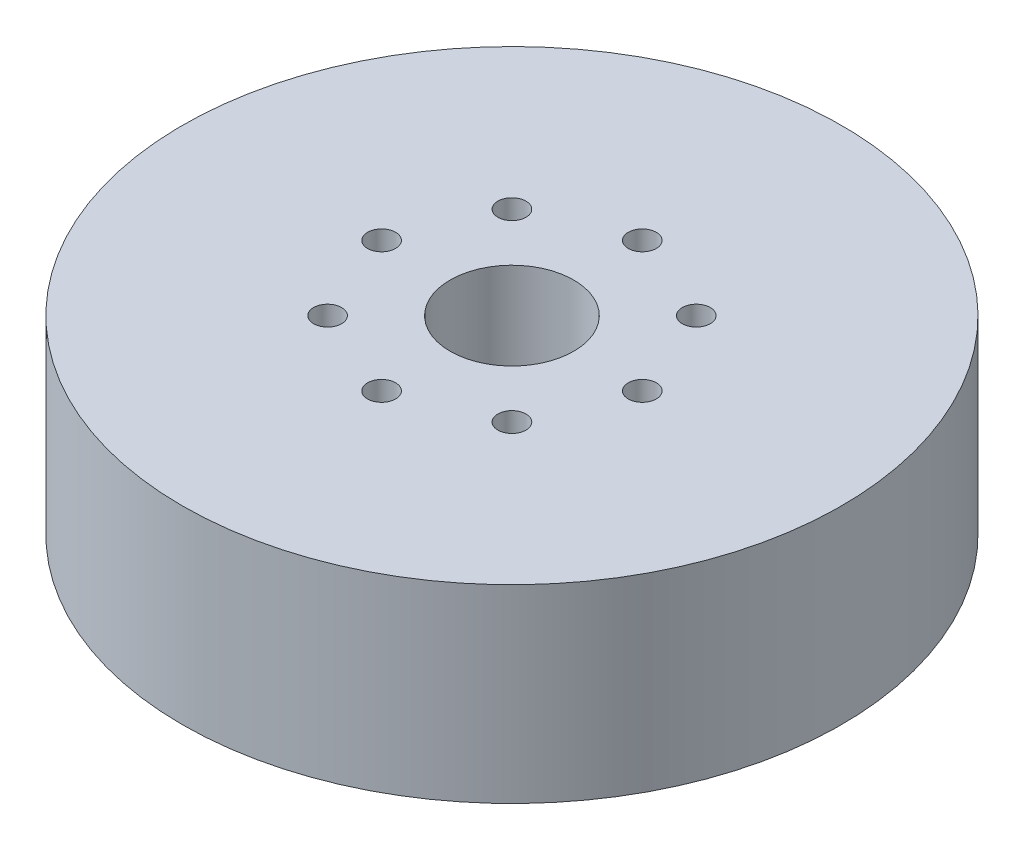
ISO-10303-21;
HEADER;
FILE_DESCRIPTION(('STEP AP214'),'2;1');
FILE_NAME('part.step','',(''),(''),'','','');
FILE_SCHEMA(('AUTOMOTIVE_DESIGN { 1 0 10303 214 1 1 1 1 }'));
ENDSEC;
DATA;
#1=APPLICATION_CONTEXT('core data for automotive mechanical design processes');
#2=APPLICATION_PROTOCOL_DEFINITION('international standard','automotive_design',2000,#1);
#3=PRODUCT_CONTEXT('',#1,'mechanical');
#4=PRODUCT('Part','Part','',(#3));
#5=PRODUCT_RELATED_PRODUCT_CATEGORY('part','',(#4));
#6=PRODUCT_DEFINITION_FORMATION('','',#4);
#7=PRODUCT_DEFINITION_CONTEXT('part definition',#1,'design');
#8=PRODUCT_DEFINITION('design','',#6,#7);
#9=PRODUCT_DEFINITION_SHAPE('','',#8);
#10=(LENGTH_UNIT() NAMED_UNIT(*) SI_UNIT(.MILLI.,.METRE.));
#11=(NAMED_UNIT(*) PLANE_ANGLE_UNIT() SI_UNIT($,.RADIAN.));
#12=(NAMED_UNIT(*) SI_UNIT($,.STERADIAN.) SOLID_ANGLE_UNIT());
#13=UNCERTAINTY_MEASURE_WITH_UNIT(LENGTH_MEASURE(1.E-05),#10,'distance_accuracy_value','');
#14=(GEOMETRIC_REPRESENTATION_CONTEXT(3) GLOBAL_UNCERTAINTY_ASSIGNED_CONTEXT((#13)) GLOBAL_UNIT_ASSIGNED_CONTEXT((#10,
#11,#12)) REPRESENTATION_CONTEXT('',''));
#15=CARTESIAN_POINT('',(0.,0.,0.));
#16=DIRECTION('',(0.,0.,1.));
#17=DIRECTION('',(1.,0.,0.));
#18=AXIS2_PLACEMENT_3D('',#15,#16,#17);
#19=CARTESIAN_POINT('',(0.,23.,0.));
#20=DIRECTION('',(0.,-1.,0.));
#21=DIRECTION('',(0.,0.,-1.));
#22=AXIS2_PLACEMENT_3D('',#19,#20,#21);
#23=CYLINDRICAL_SURFACE('',#22,40.);
#24=CARTESIAN_POINT('',(0.,23.,0.));
#25=DIRECTION('',(0.,1.,0.));
#26=DIRECTION('',(0.,0.,1.));
#27=AXIS2_PLACEMENT_3D('',#24,#25,#26);
#28=CIRCLE('',#27,40.);
#29=CARTESIAN_POINT('',(0.,23.,40.));
#30=VERTEX_POINT('',#29);
#31=EDGE_CURVE('E10',#30,#30,#28,.T.);
#32=ORIENTED_EDGE('',*,*,#31,.F.);
#33=EDGE_LOOP('',(#32));
#34=FACE_BOUND('',#33,.T.);
#35=CARTESIAN_POINT('',(0.,0.,0.));
#36=DIRECTION('',(0.,1.,0.));
#37=DIRECTION('',(0.,0.,1.));
#38=AXIS2_PLACEMENT_3D('',#35,#36,#37);
#39=CIRCLE('',#38,40.);
#40=CARTESIAN_POINT('',(0.,0.,40.));
#41=VERTEX_POINT('',#40);
#42=EDGE_CURVE('E37',#41,#41,#39,.T.);
#43=ORIENTED_EDGE('',*,*,#42,.T.);
#44=EDGE_LOOP('',(#43));
#45=FACE_BOUND('',#44,.T.);
#46=ADVANCED_FACE('F40',(#34,#45),#23,.T.);
#47=CARTESIAN_POINT('',(0.,23.,0.));
#48=DIRECTION('',(0.,1.,0.));
#49=DIRECTION('',(0.,0.,1.));
#50=AXIS2_PLACEMENT_3D('',#47,#48,#49);
#51=PLANE('',#50);
#52=CARTESIAN_POINT('',(0.,23.,15.8196777522816));
#53=DIRECTION('',(0.,1.,0.));
#54=DIRECTION('',(1.,0.,0.));
#55=AXIS2_PLACEMENT_3D('',#52,#53,#54);
#56=CIRCLE('',#55,1.70390734425643);
#57=CARTESIAN_POINT('',(1.70390734425648,23.,15.8196777522816));
#58=VERTEX_POINT('',#57);
#59=EDGE_CURVE('E88',#58,#58,#56,.T.);
#60=ORIENTED_EDGE('',*,*,#59,.F.);
#61=EDGE_LOOP('',(#60));
#62=FACE_BOUND('',#61,.T.);
#63=CARTESIAN_POINT('',(11.1862014148243,23.,11.1862014148242));
#64=DIRECTION('',(0.,1.,0.));
#65=DIRECTION('',(0.707106781186544,0.,-0.707106781186551));
#66=AXIS2_PLACEMENT_3D('',#63,#64,#65);
#67=CIRCLE('',#66,1.70390734425643);
#68=CARTESIAN_POINT('',(12.3910458524616,23.,9.98135697718694));
#69=VERTEX_POINT('',#68);
#70=EDGE_CURVE('E79',#69,#69,#67,.T.);
#71=ORIENTED_EDGE('',*,*,#70,.F.);
#72=EDGE_LOOP('',(#71));
#73=FACE_BOUND('',#72,.T.);
#74=CARTESIAN_POINT('',(15.8196777522816,23.,0.));
#75=DIRECTION('',(0.,1.,0.));
#76=DIRECTION('',(0.,0.,-1.));
#77=AXIS2_PLACEMENT_3D('',#74,#75,#76);
#78=CIRCLE('',#77,1.70390734425643);
#79=CARTESIAN_POINT('',(15.8196777522816,23.,-1.70390734425643));
#80=VERTEX_POINT('',#79);
#81=EDGE_CURVE('E74',#80,#80,#78,.T.);
#82=ORIENTED_EDGE('',*,*,#81,.F.);
#83=EDGE_LOOP('',(#82));
#84=FACE_BOUND('',#83,.T.);
#85=CARTESIAN_POINT('',(11.1862014148242,23.,-11.1862014148244));
#86=DIRECTION('',(0.,1.,0.));
#87=DIRECTION('',(-0.707106781186554,0.,-0.707106781186541));
#88=AXIS2_PLACEMENT_3D('',#85,#86,#87);
#89=CIRCLE('',#88,1.70390734425643);
#90=CARTESIAN_POINT('',(9.9813569771869,23.,-12.3910458524617));
#91=VERTEX_POINT('',#90);
#92=EDGE_CURVE('E70',#91,#91,#89,.T.);
#93=ORIENTED_EDGE('',*,*,#92,.F.);
#94=EDGE_LOOP('',(#93));
#95=FACE_BOUND('',#94,.T.);
#96=CARTESIAN_POINT('',(-1.65702328975809E-13,23.,-15.8196777522816));
#97=DIRECTION('',(0.,1.,0.));
#98=DIRECTION('',(-1.,0.,0.));
#99=AXIS2_PLACEMENT_3D('',#96,#97,#98);
#100=CIRCLE('',#99,1.70390734425643);
#101=CARTESIAN_POINT('',(-1.70390734425659,23.,-15.8196777522816));
#102=VERTEX_POINT('',#101);
#103=EDGE_CURVE('E100',#102,#102,#100,.T.);
#104=ORIENTED_EDGE('',*,*,#103,.F.);
#105=EDGE_LOOP('',(#104));
#106=FACE_BOUND('',#105,.T.);
#107=CARTESIAN_POINT('',(-11.1862014148244,23.,-11.1862014148241));
#108=DIRECTION('',(0.,1.,0.));
#109=DIRECTION('',(-0.707106781186539,0.,0.707106781186556));
#110=AXIS2_PLACEMENT_3D('',#107,#108,#109);
#111=CIRCLE('',#110,1.70390734425643);
#112=CARTESIAN_POINT('',(-12.3910458524617,23.,-9.98135697718685));
#113=VERTEX_POINT('',#112);
#114=EDGE_CURVE('E93',#113,#113,#111,.T.);
#115=ORIENTED_EDGE('',*,*,#114,.F.);
#116=EDGE_LOOP('',(#115));
#117=FACE_BOUND('',#116,.T.);
#118=CARTESIAN_POINT('',(-11.1862014148243,23.,11.1862014148243));
#119=DIRECTION('',(0.,1.,0.));
#120=DIRECTION('',(0.707106781186549,0.,0.707106781186546));
#121=AXIS2_PLACEMENT_3D('',#118,#119,#120);
#122=CIRCLE('',#121,1.70390734425643);
#123=CARTESIAN_POINT('',(-9.98135697718698,23.,12.3910458524616));
#124=VERTEX_POINT('',#123);
#125=EDGE_CURVE('E61',#124,#124,#122,.T.);
#126=ORIENTED_EDGE('',*,*,#125,.F.);
#127=EDGE_LOOP('',(#126));
#128=FACE_BOUND('',#127,.T.);
#129=CARTESIAN_POINT('',(-15.8196777522816,23.,0.));
#130=DIRECTION('',(0.,1.,0.));
#131=DIRECTION('',(0.,0.,1.));
#132=AXIS2_PLACEMENT_3D('',#129,#130,#131);
#133=CIRCLE('',#132,1.70390734425643);
#134=CARTESIAN_POINT('',(-15.8196777522816,23.,1.70390734425643));
#135=VERTEX_POINT('',#134);
#136=EDGE_CURVE('E54',#135,#135,#133,.T.);
#137=ORIENTED_EDGE('',*,*,#136,.F.);
#138=EDGE_LOOP('',(#137));
#139=FACE_BOUND('',#138,.T.);
#140=CARTESIAN_POINT('',(0.,23.,0.));
#141=DIRECTION('',(0.,1.,0.));
#142=DIRECTION('',(0.,0.,1.));
#143=AXIS2_PLACEMENT_3D('',#140,#141,#142);
#144=CIRCLE('',#143,7.5);
#145=CARTESIAN_POINT('',(0.,23.,7.5));
#146=VERTEX_POINT('',#145);
#147=EDGE_CURVE('E50',#146,#146,#144,.T.);
#148=ORIENTED_EDGE('',*,*,#147,.F.);
#149=EDGE_LOOP('',(#148));
#150=FACE_BOUND('',#149,.T.);
#151=ORIENTED_EDGE('',*,*,#31,.T.);
#152=EDGE_LOOP('',(#151));
#153=FACE_BOUND('',#152,.T.);
#154=ADVANCED_FACE('F115',(#62,#73,#84,#95,#106,#117,#128,#139,#150,#153),#51,.T.);
#155=CARTESIAN_POINT('',(0.,0.,0.));
#156=DIRECTION('',(0.,1.,0.));
#157=DIRECTION('',(0.,0.,1.));
#158=AXIS2_PLACEMENT_3D('',#155,#156,#157);
#159=PLANE('',#158);
#160=CARTESIAN_POINT('',(0.,0.,0.));
#161=DIRECTION('',(0.,1.,0.));
#162=DIRECTION('',(0.,0.,1.));
#163=AXIS2_PLACEMENT_3D('',#160,#161,#162);
#164=CIRCLE('',#163,7.5);
#165=CARTESIAN_POINT('',(0.,0.,7.5));
#166=VERTEX_POINT('',#165);
#167=EDGE_CURVE('E47',#166,#166,#164,.T.);
#168=ORIENTED_EDGE('',*,*,#167,.T.);
#169=EDGE_LOOP('',(#168));
#170=FACE_BOUND('',#169,.T.);
#171=ORIENTED_EDGE('',*,*,#42,.F.);
#172=EDGE_LOOP('',(#171));
#173=FACE_BOUND('',#172,.T.);
#174=ADVANCED_FACE('F113',(#170,#173),#159,.F.);
#175=CARTESIAN_POINT('',(0.,23.,0.));
#176=DIRECTION('',(0.,-1.,0.));
#177=DIRECTION('',(0.,0.,-1.));
#178=AXIS2_PLACEMENT_3D('',#175,#176,#177);
#179=CYLINDRICAL_SURFACE('',#178,7.5);
#180=ORIENTED_EDGE('',*,*,#147,.T.);
#181=EDGE_LOOP('',(#180));
#182=FACE_BOUND('',#181,.T.);
#183=ORIENTED_EDGE('',*,*,#167,.F.);
#184=EDGE_LOOP('',(#183));
#185=FACE_BOUND('',#184,.T.);
#186=ADVANCED_FACE('F127',(#182,#185),#179,.F.);
#187=CARTESIAN_POINT('',(-15.8196777522816,6.71406212941944,0.));
#188=DIRECTION('',(0.,1.,0.));
#189=DIRECTION('',(0.,0.,1.));
#190=AXIS2_PLACEMENT_3D('',#187,#188,#189);
#191=CYLINDRICAL_SURFACE('',#190,1.70390734425643);
#192=CARTESIAN_POINT('',(-15.8196777522816,6.71406212941944,0.));
#193=DIRECTION('',(0.,1.,0.));
#194=DIRECTION('',(0.,0.,1.));
#195=AXIS2_PLACEMENT_3D('',#192,#193,#194);
#196=CIRCLE('',#195,1.70390734425643);
#197=CARTESIAN_POINT('',(-15.8196777522816,6.71406212941944,1.70390734425643));
#198=VERTEX_POINT('',#197);
#199=EDGE_CURVE('E55',#198,#198,#196,.T.);
#200=ORIENTED_EDGE('',*,*,#199,.F.);
#201=EDGE_LOOP('',(#200));
#202=FACE_BOUND('',#201,.T.);
#203=ORIENTED_EDGE('',*,*,#136,.T.);
#204=EDGE_LOOP('',(#203));
#205=FACE_BOUND('',#204,.T.);
#206=ADVANCED_FACE('F129',(#202,#205),#191,.F.);
#207=CARTESIAN_POINT('',(-15.8196777522816,6.71406212941944,0.));
#208=DIRECTION('',(0.,1.,0.));
#209=DIRECTION('',(0.,0.,1.));
#210=AXIS2_PLACEMENT_3D('',#207,#208,#209);
#211=PLANE('',#210);
#212=ORIENTED_EDGE('',*,*,#199,.T.);
#213=EDGE_LOOP('',(#212));
#214=FACE_BOUND('',#213,.T.);
#215=ADVANCED_FACE('F157',(#214),#211,.T.);
#216=CARTESIAN_POINT('',(-11.1862014148243,6.71406212941944,11.1862014148243));
#217=DIRECTION('',(0.,1.,0.));
#218=DIRECTION('',(0.,0.,1.));
#219=AXIS2_PLACEMENT_3D('',#216,#217,#218);
#220=CYLINDRICAL_SURFACE('',#219,1.70390734425643);
#221=CARTESIAN_POINT('',(-11.1862014148243,6.71406212941944,11.1862014148243));
#222=DIRECTION('',(0.,1.,0.));
#223=DIRECTION('',(0.707106781186549,0.,0.707106781186546));
#224=AXIS2_PLACEMENT_3D('',#221,#222,#223);
#225=CIRCLE('',#224,1.70390734425643);
#226=CARTESIAN_POINT('',(-9.98135697718698,6.71406212941944,12.3910458524616));
#227=VERTEX_POINT('',#226);
#228=EDGE_CURVE('E59',#227,#227,#225,.T.);
#229=ORIENTED_EDGE('',*,*,#228,.F.);
#230=EDGE_LOOP('',(#229));
#231=FACE_BOUND('',#230,.T.);
#232=ORIENTED_EDGE('',*,*,#125,.T.);
#233=EDGE_LOOP('',(#232));
#234=FACE_BOUND('',#233,.T.);
#235=ADVANCED_FACE('F170',(#231,#234),#220,.F.);
#236=CARTESIAN_POINT('',(-11.1862014148243,6.71406212941944,11.1862014148243));
#237=DIRECTION('',(0.,1.,0.));
#238=DIRECTION('',(0.707106781186549,0.,0.707106781186546));
#239=AXIS2_PLACEMENT_3D('',#236,#237,#238);
#240=PLANE('',#239);
#241=ORIENTED_EDGE('',*,*,#228,.T.);
#242=EDGE_LOOP('',(#241));
#243=FACE_BOUND('',#242,.T.);
#244=ADVANCED_FACE('F182',(#243),#240,.T.);
#245=CARTESIAN_POINT('',(-11.1862014148244,6.71406212941944,-11.1862014148241));
#246=DIRECTION('',(0.,1.,0.));
#247=DIRECTION('',(0.,0.,1.));
#248=AXIS2_PLACEMENT_3D('',#245,#246,#247);
#249=CYLINDRICAL_SURFACE('',#248,1.70390734425643);
#250=CARTESIAN_POINT('',(-11.1862014148244,6.71406212941944,-11.1862014148241));
#251=DIRECTION('',(0.,1.,0.));
#252=DIRECTION('',(-0.707106781186539,0.,0.707106781186556));
#253=AXIS2_PLACEMENT_3D('',#250,#251,#252);
#254=CIRCLE('',#253,1.70390734425643);
#255=CARTESIAN_POINT('',(-12.3910458524617,6.71406212941944,-9.98135697718685));
#256=VERTEX_POINT('',#255);
#257=EDGE_CURVE('E94',#256,#256,#254,.T.);
#258=ORIENTED_EDGE('',*,*,#257,.F.);
#259=EDGE_LOOP('',(#258));
#260=FACE_BOUND('',#259,.T.);
#261=ORIENTED_EDGE('',*,*,#114,.T.);
#262=EDGE_LOOP('',(#261));
#263=FACE_BOUND('',#262,.T.);
#264=ADVANCED_FACE('F189',(#260,#263),#249,.F.);
#265=CARTESIAN_POINT('',(-11.1862014148244,6.71406212941944,-11.1862014148241));
#266=DIRECTION('',(0.,1.,0.));
#267=DIRECTION('',(-0.707106781186539,0.,0.707106781186556));
#268=AXIS2_PLACEMENT_3D('',#265,#266,#267);
#269=PLANE('',#268);
#270=ORIENTED_EDGE('',*,*,#257,.T.);
#271=EDGE_LOOP('',(#270));
#272=FACE_BOUND('',#271,.T.);
#273=ADVANCED_FACE('F107',(#272),#269,.T.);
#274=CARTESIAN_POINT('',(-1.65702328975809E-13,6.71406212941944,-15.8196777522816));
#275=DIRECTION('',(0.,1.,0.));
#276=DIRECTION('',(0.,0.,1.));
#277=AXIS2_PLACEMENT_3D('',#274,#275,#276);
#278=CYLINDRICAL_SURFACE('',#277,1.70390734425643);
#279=CARTESIAN_POINT('',(-1.65702328975809E-13,6.71406212941944,-15.8196777522816));
#280=DIRECTION('',(0.,1.,0.));
#281=DIRECTION('',(-1.,0.,0.));
#282=AXIS2_PLACEMENT_3D('',#279,#280,#281);
#283=CIRCLE('',#282,1.70390734425643);
#284=CARTESIAN_POINT('',(-1.70390734425659,6.71406212941944,-15.8196777522816));
#285=VERTEX_POINT('',#284);
#286=EDGE_CURVE('E72',#285,#285,#283,.T.);
#287=ORIENTED_EDGE('',*,*,#286,.F.);
#288=EDGE_LOOP('',(#287));
#289=FACE_BOUND('',#288,.T.);
#290=ORIENTED_EDGE('',*,*,#103,.T.);
#291=EDGE_LOOP('',(#290));
#292=FACE_BOUND('',#291,.T.);
#293=ADVANCED_FACE('F104',(#289,#292),#278,.F.);
#294=CARTESIAN_POINT('',(-1.65702328975809E-13,6.71406212941944,-15.8196777522816));
#295=DIRECTION('',(0.,1.,0.));
#296=DIRECTION('',(-1.,0.,0.));
#297=AXIS2_PLACEMENT_3D('',#294,#295,#296);
#298=PLANE('',#297);
#299=ORIENTED_EDGE('',*,*,#286,.T.);
#300=EDGE_LOOP('',(#299));
#301=FACE_BOUND('',#300,.T.);
#302=ADVANCED_FACE('F103',(#301),#298,.T.);
#303=CARTESIAN_POINT('',(11.1862014148242,6.71406212941944,-11.1862014148244));
#304=DIRECTION('',(0.,1.,0.));
#305=DIRECTION('',(0.,0.,1.));
#306=AXIS2_PLACEMENT_3D('',#303,#304,#305);
#307=CYLINDRICAL_SURFACE('',#306,1.70390734425643);
#308=CARTESIAN_POINT('',(11.1862014148242,6.71406212941944,-11.1862014148244));
#309=DIRECTION('',(0.,1.,0.));
#310=DIRECTION('',(-0.707106781186554,0.,-0.707106781186541));
#311=AXIS2_PLACEMENT_3D('',#308,#309,#310);
#312=CIRCLE('',#311,1.70390734425643);
#313=CARTESIAN_POINT('',(9.9813569771869,6.71406212941944,-12.3910458524617));
#314=VERTEX_POINT('',#313);
#315=EDGE_CURVE('E69',#314,#314,#312,.T.);
#316=ORIENTED_EDGE('',*,*,#315,.F.);
#317=EDGE_LOOP('',(#316));
#318=FACE_BOUND('',#317,.T.);
#319=ORIENTED_EDGE('',*,*,#92,.T.);
#320=EDGE_LOOP('',(#319));
#321=FACE_BOUND('',#320,.T.);
#322=ADVANCED_FACE('F219',(#318,#321),#307,.F.);
#323=CARTESIAN_POINT('',(11.1862014148242,6.71406212941944,-11.1862014148244));
#324=DIRECTION('',(0.,1.,0.));
#325=DIRECTION('',(-0.707106781186554,0.,-0.707106781186541));
#326=AXIS2_PLACEMENT_3D('',#323,#324,#325);
#327=PLANE('',#326);
#328=ORIENTED_EDGE('',*,*,#315,.T.);
#329=EDGE_LOOP('',(#328));
#330=FACE_BOUND('',#329,.T.);
#331=ADVANCED_FACE('F227',(#330),#327,.T.);
#332=CARTESIAN_POINT('',(15.8196777522816,6.71406212941944,0.));
#333=DIRECTION('',(0.,1.,0.));
#334=DIRECTION('',(0.,0.,1.));
#335=AXIS2_PLACEMENT_3D('',#332,#333,#334);
#336=CYLINDRICAL_SURFACE('',#335,1.70390734425643);
#337=CARTESIAN_POINT('',(15.8196777522816,6.71406212941944,0.));
#338=DIRECTION('',(0.,1.,0.));
#339=DIRECTION('',(0.,0.,-1.));
#340=AXIS2_PLACEMENT_3D('',#337,#338,#339);
#341=CIRCLE('',#340,1.70390734425643);
#342=CARTESIAN_POINT('',(15.8196777522816,6.71406212941944,-1.70390734425643));
#343=VERTEX_POINT('',#342);
#344=EDGE_CURVE('E80',#343,#343,#341,.T.);
#345=ORIENTED_EDGE('',*,*,#344,.F.);
#346=EDGE_LOOP('',(#345));
#347=FACE_BOUND('',#346,.T.);
#348=ORIENTED_EDGE('',*,*,#81,.T.);
#349=EDGE_LOOP('',(#348));
#350=FACE_BOUND('',#349,.T.);
#351=ADVANCED_FACE('F240',(#347,#350),#336,.F.);
#352=CARTESIAN_POINT('',(15.8196777522816,6.71406212941944,0.));
#353=DIRECTION('',(0.,1.,0.));
#354=DIRECTION('',(0.,0.,-1.));
#355=AXIS2_PLACEMENT_3D('',#352,#353,#354);
#356=PLANE('',#355);
#357=ORIENTED_EDGE('',*,*,#344,.T.);
#358=EDGE_LOOP('',(#357));
#359=FACE_BOUND('',#358,.T.);
#360=ADVANCED_FACE('F246',(#359),#356,.T.);
#361=CARTESIAN_POINT('',(11.1862014148243,6.71406212941944,11.1862014148242));
#362=DIRECTION('',(0.,1.,0.));
#363=DIRECTION('',(0.,0.,1.));
#364=AXIS2_PLACEMENT_3D('',#361,#362,#363);
#365=CYLINDRICAL_SURFACE('',#364,1.70390734425643);
#366=CARTESIAN_POINT('',(11.1862014148243,6.71406212941944,11.1862014148242));
#367=DIRECTION('',(0.,1.,0.));
#368=DIRECTION('',(0.707106781186544,0.,-0.707106781186551));
#369=AXIS2_PLACEMENT_3D('',#366,#367,#368);
#370=CIRCLE('',#369,1.70390734425643);
#371=CARTESIAN_POINT('',(12.3910458524616,6.71406212941944,9.98135697718694));
#372=VERTEX_POINT('',#371);
#373=EDGE_CURVE('E82',#372,#372,#370,.T.);
#374=ORIENTED_EDGE('',*,*,#373,.F.);
#375=EDGE_LOOP('',(#374));
#376=FACE_BOUND('',#375,.T.);
#377=ORIENTED_EDGE('',*,*,#70,.T.);
#378=EDGE_LOOP('',(#377));
#379=FACE_BOUND('',#378,.T.);
#380=ADVANCED_FACE('F254',(#376,#379),#365,.F.);
#381=CARTESIAN_POINT('',(11.1862014148243,6.71406212941944,11.1862014148242));
#382=DIRECTION('',(0.,1.,0.));
#383=DIRECTION('',(0.707106781186544,0.,-0.707106781186551));
#384=AXIS2_PLACEMENT_3D('',#381,#382,#383);
#385=PLANE('',#384);
#386=ORIENTED_EDGE('',*,*,#373,.T.);
#387=EDGE_LOOP('',(#386));
#388=FACE_BOUND('',#387,.T.);
#389=ADVANCED_FACE('F262',(#388),#385,.T.);
#390=CARTESIAN_POINT('',(0.,6.71406212941944,15.8196777522816));
#391=DIRECTION('',(0.,1.,0.));
#392=DIRECTION('',(0.,0.,1.));
#393=AXIS2_PLACEMENT_3D('',#390,#391,#392);
#394=CYLINDRICAL_SURFACE('',#393,1.70390734425643);
#395=CARTESIAN_POINT('',(0.,6.71406212941944,15.8196777522816));
#396=DIRECTION('',(0.,1.,0.));
#397=DIRECTION('',(1.,0.,0.));
#398=AXIS2_PLACEMENT_3D('',#395,#396,#397);
#399=CIRCLE('',#398,1.70390734425643);
#400=CARTESIAN_POINT('',(1.70390734425648,6.71406212941944,15.8196777522816));
#401=VERTEX_POINT('',#400);
#402=EDGE_CURVE('E63',#401,#401,#399,.T.);
#403=ORIENTED_EDGE('',*,*,#402,.F.);
#404=EDGE_LOOP('',(#403));
#405=FACE_BOUND('',#404,.T.);
#406=ORIENTED_EDGE('',*,*,#59,.T.);
#407=EDGE_LOOP('',(#406));
#408=FACE_BOUND('',#407,.T.);
#409=ADVANCED_FACE('F272',(#405,#408),#394,.F.);
#410=CARTESIAN_POINT('',(0.,6.71406212941944,15.8196777522816));
#411=DIRECTION('',(0.,1.,0.));
#412=DIRECTION('',(1.,0.,0.));
#413=AXIS2_PLACEMENT_3D('',#410,#411,#412);
#414=PLANE('',#413);
#415=ORIENTED_EDGE('',*,*,#402,.T.);
#416=EDGE_LOOP('',(#415));
#417=FACE_BOUND('',#416,.T.);
#418=ADVANCED_FACE('F285',(#417),#414,.T.);
#419=CLOSED_SHELL('',(#46,#154,#174,#186,#206,#215,#235,#244,#264,#273,#293,#302,#322,#331,#351,
#360,#380,#389,#409,#418));
#420=MANIFOLD_SOLID_BREP('B2',#419);
#421=ADVANCED_BREP_SHAPE_REPRESENTATION('',(#18,#420),#14);
#422=SHAPE_DEFINITION_REPRESENTATION(#9,#421);
ENDSEC;
END-ISO-10303-21;
